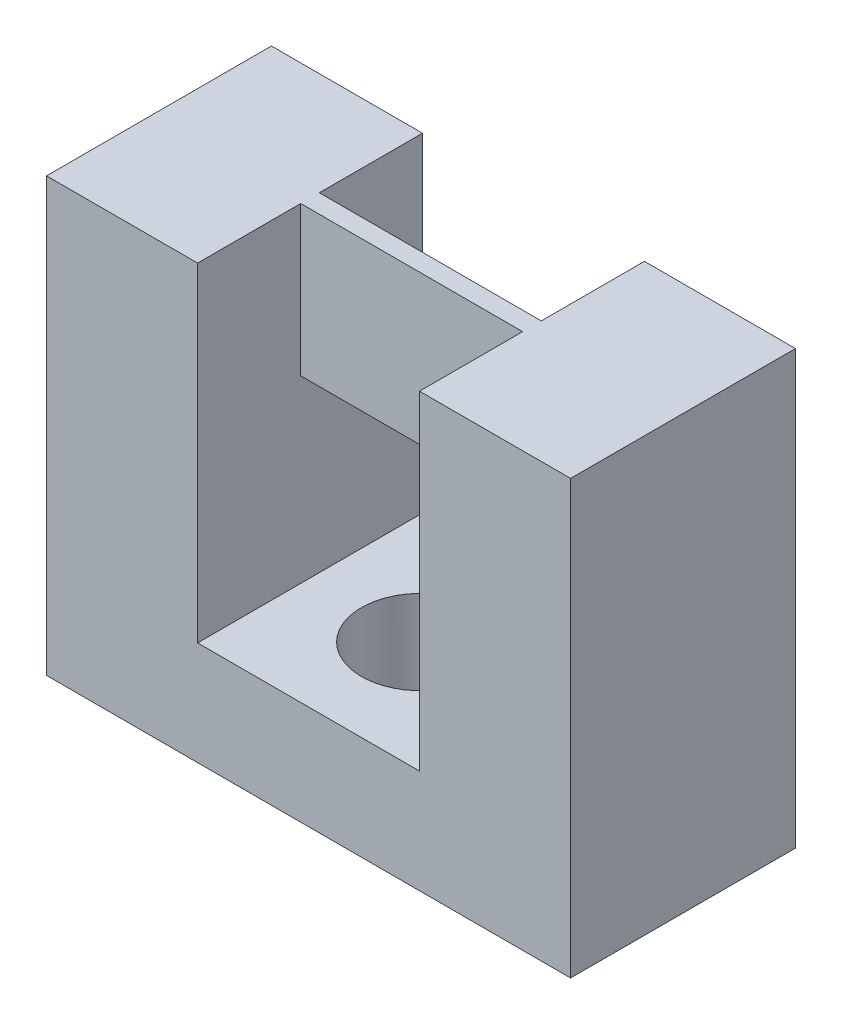
ISO-10303-21;
HEADER;
FILE_DESCRIPTION(('STEP AP214'),'2;1');
FILE_NAME('part.step','',(''),(''),'','','');
FILE_SCHEMA(('AUTOMOTIVE_DESIGN { 1 0 10303 214 1 1 1 1 }'));
ENDSEC;
DATA;
#1=APPLICATION_CONTEXT('core data for automotive mechanical design processes');
#2=APPLICATION_PROTOCOL_DEFINITION('international standard','automotive_design',2000,#1);
#3=PRODUCT_CONTEXT('',#1,'mechanical');
#4=PRODUCT('Part','Part','',(#3));
#5=PRODUCT_RELATED_PRODUCT_CATEGORY('part','',(#4));
#6=PRODUCT_DEFINITION_FORMATION('','',#4);
#7=PRODUCT_DEFINITION_CONTEXT('part definition',#1,'design');
#8=PRODUCT_DEFINITION('design','',#6,#7);
#9=PRODUCT_DEFINITION_SHAPE('','',#8);
#10=(LENGTH_UNIT() NAMED_UNIT(*) SI_UNIT(.MILLI.,.METRE.));
#11=(NAMED_UNIT(*) PLANE_ANGLE_UNIT() SI_UNIT($,.RADIAN.));
#12=(NAMED_UNIT(*) SI_UNIT($,.STERADIAN.) SOLID_ANGLE_UNIT());
#13=UNCERTAINTY_MEASURE_WITH_UNIT(LENGTH_MEASURE(1.E-05),#10,'distance_accuracy_value','');
#14=(GEOMETRIC_REPRESENTATION_CONTEXT(3) GLOBAL_UNCERTAINTY_ASSIGNED_CONTEXT((#13)) GLOBAL_UNIT_ASSIGNED_CONTEXT((#10,
#11,#12)) REPRESENTATION_CONTEXT('',''));
#15=CARTESIAN_POINT('',(0.,0.,0.));
#16=DIRECTION('',(0.,0.,1.));
#17=DIRECTION('',(1.,0.,0.));
#18=AXIS2_PLACEMENT_3D('',#15,#16,#17);
#19=CARTESIAN_POINT('',(2.975,5.8,0.));
#20=DIRECTION('',(1.,0.,0.));
#21=DIRECTION('',(0.,1.,0.));
#22=AXIS2_PLACEMENT_3D('',#19,#20,#21);
#23=PLANE('',#22);
#24=DIRECTION('',(0.,1.,0.));
#25=VECTOR('',#24,1.);
#26=CARTESIAN_POINT('',(2.975,5.8,3.265));
#27=LINE('',#26,#25);
#28=CARTESIAN_POINT('',(2.975,1.8,3.265));
#29=VERTEX_POINT('',#28);
#30=CARTESIAN_POINT('',(2.975,5.8,3.265));
#31=VERTEX_POINT('',#30);
#32=EDGE_CURVE('E143',#29,#31,#27,.T.);
#33=ORIENTED_EDGE('',*,*,#32,.F.);
#34=DIRECTION('',(0.,0.,1.));
#35=VECTOR('',#34,1.);
#36=CARTESIAN_POINT('',(2.975,1.8,0.));
#37=LINE('',#36,#35);
#38=CARTESIAN_POINT('',(2.975,1.8,2.765));
#39=VERTEX_POINT('',#38);
#40=EDGE_CURVE('E161',#39,#29,#37,.T.);
#41=ORIENTED_EDGE('',*,*,#40,.F.);
#42=DIRECTION('',(0.,-1.,0.));
#43=VECTOR('',#42,1.);
#44=CARTESIAN_POINT('',(2.975,5.8,2.765));
#45=LINE('',#44,#43);
#46=CARTESIAN_POINT('',(2.975,5.8,2.765));
#47=VERTEX_POINT('',#46);
#48=EDGE_CURVE('E159',#47,#39,#45,.T.);
#49=ORIENTED_EDGE('',*,*,#48,.F.);
#50=DIRECTION('',(0.,0.,1.));
#51=VECTOR('',#50,1.);
#52=CARTESIAN_POINT('',(2.975,5.8,0.));
#53=LINE('',#52,#51);
#54=CARTESIAN_POINT('',(2.975,5.8,0.));
#55=VERTEX_POINT('',#54);
#56=EDGE_CURVE('E180',#55,#47,#53,.T.);
#57=ORIENTED_EDGE('',*,*,#56,.F.);
#58=DIRECTION('',(0.,1.,0.));
#59=VECTOR('',#58,1.);
#60=CARTESIAN_POINT('',(2.975,5.8,0.));
#61=LINE('',#60,#59);
#62=CARTESIAN_POINT('',(2.975,-3.02,0.));
#63=VERTEX_POINT('',#62);
#64=EDGE_CURVE('E132',#63,#55,#61,.T.);
#65=ORIENTED_EDGE('',*,*,#64,.F.);
#66=DIRECTION('',(0.,0.,1.));
#67=VECTOR('',#66,1.);
#68=CARTESIAN_POINT('',(2.975,-3.02,0.));
#69=LINE('',#68,#67);
#70=CARTESIAN_POINT('',(2.975,-3.02,6.03));
#71=VERTEX_POINT('',#70);
#72=EDGE_CURVE('E184',#63,#71,#69,.T.);
#73=ORIENTED_EDGE('',*,*,#72,.T.);
#74=DIRECTION('',(0.,1.,0.));
#75=VECTOR('',#74,1.);
#76=CARTESIAN_POINT('',(2.975,5.8,6.03));
#77=LINE('',#76,#75);
#78=CARTESIAN_POINT('',(2.975,5.8,6.03));
#79=VERTEX_POINT('',#78);
#80=EDGE_CURVE('E169',#71,#79,#77,.T.);
#81=ORIENTED_EDGE('',*,*,#80,.T.);
#82=EDGE_CURVE('E183',#31,#79,#53,.T.);
#83=ORIENTED_EDGE('',*,*,#82,.F.);
#84=EDGE_LOOP('',(#33,#41,#49,#57,#65,#73,#81,#83));
#85=FACE_BOUND('',#84,.T.);
#86=ADVANCED_FACE('F36',(#85),#23,.F.);
#87=CARTESIAN_POINT('',(-2.975,-3.02,0.));
#88=DIRECTION('',(-1.,0.,0.));
#89=DIRECTION('',(0.,0.,1.));
#90=AXIS2_PLACEMENT_3D('',#87,#88,#89);
#91=PLANE('',#90);
#92=DIRECTION('',(0.,-1.,0.));
#93=VECTOR('',#92,1.);
#94=CARTESIAN_POINT('',(-2.975,5.8,3.265));
#95=LINE('',#94,#93);
#96=CARTESIAN_POINT('',(-2.975,5.8,3.265));
#97=VERTEX_POINT('',#96);
#98=CARTESIAN_POINT('',(-2.975,1.8,3.265));
#99=VERTEX_POINT('',#98);
#100=EDGE_CURVE('E135',#97,#99,#95,.T.);
#101=ORIENTED_EDGE('',*,*,#100,.F.);
#102=DIRECTION('',(0.,0.,1.));
#103=VECTOR('',#102,1.);
#104=CARTESIAN_POINT('',(-2.975,5.8,0.));
#105=LINE('',#104,#103);
#106=CARTESIAN_POINT('',(-2.975,5.8,6.03));
#107=VERTEX_POINT('',#106);
#108=EDGE_CURVE('E124',#97,#107,#105,.T.);
#109=ORIENTED_EDGE('',*,*,#108,.T.);
#110=DIRECTION('',(0.,-1.,0.));
#111=VECTOR('',#110,1.);
#112=CARTESIAN_POINT('',(-2.975,-3.02,6.03));
#113=LINE('',#112,#111);
#114=CARTESIAN_POINT('',(-2.975,-3.02,6.03));
#115=VERTEX_POINT('',#114);
#116=EDGE_CURVE('E164',#107,#115,#113,.T.);
#117=ORIENTED_EDGE('',*,*,#116,.T.);
#118=DIRECTION('',(0.,0.,1.));
#119=VECTOR('',#118,1.);
#120=CARTESIAN_POINT('',(-2.975,-3.02,0.));
#121=LINE('',#120,#119);
#122=CARTESIAN_POINT('',(-2.975,-3.02,0.));
#123=VERTEX_POINT('',#122);
#124=EDGE_CURVE('E186',#123,#115,#121,.T.);
#125=ORIENTED_EDGE('',*,*,#124,.F.);
#126=DIRECTION('',(0.,-1.,0.));
#127=VECTOR('',#126,1.);
#128=CARTESIAN_POINT('',(-2.975,-3.02,0.));
#129=LINE('',#128,#127);
#130=CARTESIAN_POINT('',(-2.975,5.8,0.));
#131=VERTEX_POINT('',#130);
#132=EDGE_CURVE('E165',#131,#123,#129,.T.);
#133=ORIENTED_EDGE('',*,*,#132,.F.);
#134=CARTESIAN_POINT('',(-2.975,5.8,2.765));
#135=VERTEX_POINT('',#134);
#136=EDGE_CURVE('E131',#131,#135,#105,.T.);
#137=ORIENTED_EDGE('',*,*,#136,.T.);
#138=DIRECTION('',(0.,1.,0.));
#139=VECTOR('',#138,1.);
#140=CARTESIAN_POINT('',(-2.975,5.8,2.765));
#141=LINE('',#140,#139);
#142=CARTESIAN_POINT('',(-2.975,1.8,2.765));
#143=VERTEX_POINT('',#142);
#144=EDGE_CURVE('E146',#143,#135,#141,.T.);
#145=ORIENTED_EDGE('',*,*,#144,.F.);
#146=DIRECTION('',(0.,0.,-1.));
#147=VECTOR('',#146,1.);
#148=CARTESIAN_POINT('',(-2.975,1.8,3.265));
#149=LINE('',#148,#147);
#150=EDGE_CURVE('E59',#99,#143,#149,.T.);
#151=ORIENTED_EDGE('',*,*,#150,.F.);
#152=EDGE_LOOP('',(#101,#109,#117,#125,#133,#137,#145,#151));
#153=FACE_BOUND('',#152,.T.);
#154=ADVANCED_FACE('F136',(#153),#91,.F.);
#155=CARTESIAN_POINT('',(7.025,-5.8,6.03));
#156=DIRECTION('',(-1.,0.,0.));
#157=DIRECTION('',(0.,0.,1.));
#158=AXIS2_PLACEMENT_3D('',#155,#156,#157);
#159=PLANE('',#158);
#160=DIRECTION('',(0.,1.,0.));
#161=VECTOR('',#160,1.);
#162=CARTESIAN_POINT('',(7.025,-5.8,0.));
#163=LINE('',#162,#161);
#164=CARTESIAN_POINT('',(7.025,-5.8,0.));
#165=VERTEX_POINT('',#164);
#166=CARTESIAN_POINT('',(7.025,5.8,0.));
#167=VERTEX_POINT('',#166);
#168=EDGE_CURVE('E182',#165,#167,#163,.T.);
#169=ORIENTED_EDGE('',*,*,#168,.T.);
#170=DIRECTION('',(0.,0.,-1.));
#171=VECTOR('',#170,1.);
#172=CARTESIAN_POINT('',(7.025,5.8,6.03));
#173=LINE('',#172,#171);
#174=CARTESIAN_POINT('',(7.025,5.8,6.03));
#175=VERTEX_POINT('',#174);
#176=EDGE_CURVE('E11',#175,#167,#173,.T.);
#177=ORIENTED_EDGE('',*,*,#176,.F.);
#178=DIRECTION('',(0.,1.,0.));
#179=VECTOR('',#178,1.);
#180=CARTESIAN_POINT('',(7.025,-5.8,6.03));
#181=LINE('',#180,#179);
#182=CARTESIAN_POINT('',(7.025,-5.8,6.03));
#183=VERTEX_POINT('',#182);
#184=EDGE_CURVE('E188',#183,#175,#181,.T.);
#185=ORIENTED_EDGE('',*,*,#184,.F.);
#186=DIRECTION('',(0.,0.,-1.));
#187=VECTOR('',#186,1.);
#188=CARTESIAN_POINT('',(7.025,-5.8,6.03));
#189=LINE('',#188,#187);
#190=EDGE_CURVE('E199',#183,#165,#189,.T.);
#191=ORIENTED_EDGE('',*,*,#190,.T.);
#192=EDGE_LOOP('',(#169,#177,#185,#191));
#193=FACE_BOUND('',#192,.T.);
#194=ADVANCED_FACE('F38',(#193),#159,.F.);
#195=CARTESIAN_POINT('',(-7.025,5.8,6.03));
#196=DIRECTION('',(0.,-1.,0.));
#197=DIRECTION('',(0.,0.,-1.));
#198=AXIS2_PLACEMENT_3D('',#195,#196,#197);
#199=PLANE('',#198);
#200=ORIENTED_EDGE('',*,*,#56,.T.);
#201=DIRECTION('',(-1.,0.,0.));
#202=VECTOR('',#201,1.);
#203=CARTESIAN_POINT('',(3.055,5.8,2.765));
#204=LINE('',#203,#202);
#205=EDGE_CURVE('E145',#47,#135,#204,.T.);
#206=ORIENTED_EDGE('',*,*,#205,.T.);
#207=ORIENTED_EDGE('',*,*,#136,.F.);
#208=DIRECTION('',(-1.,0.,0.));
#209=VECTOR('',#208,1.);
#210=CARTESIAN_POINT('',(-7.025,5.8,0.));
#211=LINE('',#210,#209);
#212=CARTESIAN_POINT('',(-7.025,5.8,0.));
#213=VERTEX_POINT('',#212);
#214=EDGE_CURVE('E202',#131,#213,#211,.T.);
#215=ORIENTED_EDGE('',*,*,#214,.T.);
#216=DIRECTION('',(0.,0.,-1.));
#217=VECTOR('',#216,1.);
#218=CARTESIAN_POINT('',(-7.025,5.8,6.03));
#219=LINE('',#218,#217);
#220=CARTESIAN_POINT('',(-7.025,5.8,6.03));
#221=VERTEX_POINT('',#220);
#222=EDGE_CURVE('E44',#221,#213,#219,.T.);
#223=ORIENTED_EDGE('',*,*,#222,.F.);
#224=DIRECTION('',(-1.,0.,0.));
#225=VECTOR('',#224,1.);
#226=CARTESIAN_POINT('',(-7.025,5.8,6.03));
#227=LINE('',#226,#225);
#228=EDGE_CURVE('E128',#107,#221,#227,.T.);
#229=ORIENTED_EDGE('',*,*,#228,.F.);
#230=ORIENTED_EDGE('',*,*,#108,.F.);
#231=DIRECTION('',(-1.,0.,0.));
#232=VECTOR('',#231,1.);
#233=CARTESIAN_POINT('',(3.055,5.8,3.265));
#234=LINE('',#233,#232);
#235=EDGE_CURVE('E51',#31,#97,#234,.T.);
#236=ORIENTED_EDGE('',*,*,#235,.F.);
#237=ORIENTED_EDGE('',*,*,#82,.T.);
#238=EDGE_CURVE('E192',#175,#79,#227,.T.);
#239=ORIENTED_EDGE('',*,*,#238,.F.);
#240=ORIENTED_EDGE('',*,*,#176,.T.);
#241=EDGE_CURVE('E203',#167,#55,#211,.T.);
#242=ORIENTED_EDGE('',*,*,#241,.T.);
#243=EDGE_LOOP('',(#200,#206,#207,#215,#223,#229,#230,#236,#237,#239,#240,#242));
#244=FACE_BOUND('',#243,.T.);
#245=ADVANCED_FACE('F126',(#244),#199,.F.);
#246=CARTESIAN_POINT('',(-7.025,-5.8,6.03));
#247=DIRECTION('',(1.,0.,0.));
#248=DIRECTION('',(0.,0.,-1.));
#249=AXIS2_PLACEMENT_3D('',#246,#247,#248);
#250=PLANE('',#249);
#251=DIRECTION('',(0.,-1.,0.));
#252=VECTOR('',#251,1.);
#253=CARTESIAN_POINT('',(-7.025,-5.8,0.));
#254=LINE('',#253,#252);
#255=CARTESIAN_POINT('',(-7.025,-5.8,0.));
#256=VERTEX_POINT('',#255);
#257=EDGE_CURVE('E206',#213,#256,#254,.T.);
#258=ORIENTED_EDGE('',*,*,#257,.T.);
#259=DIRECTION('',(0.,0.,-1.));
#260=VECTOR('',#259,1.);
#261=CARTESIAN_POINT('',(-7.025,-5.8,6.03));
#262=LINE('',#261,#260);
#263=CARTESIAN_POINT('',(-7.025,-5.8,6.03));
#264=VERTEX_POINT('',#263);
#265=EDGE_CURVE('E211',#264,#256,#262,.T.);
#266=ORIENTED_EDGE('',*,*,#265,.F.);
#267=DIRECTION('',(0.,-1.,0.));
#268=VECTOR('',#267,1.);
#269=CARTESIAN_POINT('',(-7.025,-5.8,6.03));
#270=LINE('',#269,#268);
#271=EDGE_CURVE('E195',#221,#264,#270,.T.);
#272=ORIENTED_EDGE('',*,*,#271,.F.);
#273=ORIENTED_EDGE('',*,*,#222,.T.);
#274=EDGE_LOOP('',(#258,#266,#272,#273));
#275=FACE_BOUND('',#274,.T.);
#276=ADVANCED_FACE('F217',(#275),#250,.F.);
#277=CARTESIAN_POINT('',(-7.025,-5.8,6.03));
#278=DIRECTION('',(0.,1.,0.));
#279=DIRECTION('',(0.,0.,1.));
#280=AXIS2_PLACEMENT_3D('',#277,#278,#279);
#281=PLANE('',#280);
#282=CARTESIAN_POINT('',(0.,-5.8,3.015));
#283=DIRECTION('',(0.,-1.,0.));
#284=DIRECTION('',(0.,0.,-1.));
#285=AXIS2_PLACEMENT_3D('',#282,#283,#284);
#286=CIRCLE('',#285,1.6);
#287=CARTESIAN_POINT('',(0.,-5.8,1.415));
#288=VERTEX_POINT('',#287);
#289=EDGE_CURVE('E359',#288,#288,#286,.T.);
#290=ORIENTED_EDGE('',*,*,#289,.F.);
#291=EDGE_LOOP('',(#290));
#292=FACE_BOUND('',#291,.T.);
#293=DIRECTION('',(1.,0.,0.));
#294=VECTOR('',#293,1.);
#295=CARTESIAN_POINT('',(-7.025,-5.8,0.));
#296=LINE('',#295,#294);
#297=EDGE_CURVE('E191',#256,#165,#296,.T.);
#298=ORIENTED_EDGE('',*,*,#297,.T.);
#299=ORIENTED_EDGE('',*,*,#190,.F.);
#300=DIRECTION('',(1.,0.,0.));
#301=VECTOR('',#300,1.);
#302=CARTESIAN_POINT('',(-7.025,-5.8,6.03));
#303=LINE('',#302,#301);
#304=EDGE_CURVE('E197',#264,#183,#303,.T.);
#305=ORIENTED_EDGE('',*,*,#304,.F.);
#306=ORIENTED_EDGE('',*,*,#265,.T.);
#307=EDGE_LOOP('',(#298,#299,#305,#306));
#308=FACE_BOUND('',#307,.T.);
#309=ADVANCED_FACE('F226',(#292,#308),#281,.F.);
#310=CARTESIAN_POINT('',(0.,0.,6.03));
#311=DIRECTION('',(0.,0.,-1.));
#312=DIRECTION('',(-1.,0.,0.));
#313=AXIS2_PLACEMENT_3D('',#310,#311,#312);
#314=PLANE('',#313);
#315=ORIENTED_EDGE('',*,*,#238,.T.);
#316=ORIENTED_EDGE('',*,*,#80,.F.);
#317=DIRECTION('',(1.,0.,0.));
#318=VECTOR('',#317,1.);
#319=CARTESIAN_POINT('',(2.975,-3.02,6.03));
#320=LINE('',#319,#318);
#321=EDGE_CURVE('E175',#115,#71,#320,.T.);
#322=ORIENTED_EDGE('',*,*,#321,.F.);
#323=ORIENTED_EDGE('',*,*,#116,.F.);
#324=ORIENTED_EDGE('',*,*,#228,.T.);
#325=ORIENTED_EDGE('',*,*,#271,.T.);
#326=ORIENTED_EDGE('',*,*,#304,.T.);
#327=ORIENTED_EDGE('',*,*,#184,.T.);
#328=EDGE_LOOP('',(#315,#316,#322,#323,#324,#325,#326,#327));
#329=FACE_BOUND('',#328,.T.);
#330=ADVANCED_FACE('F232',(#329),#314,.F.);
#331=CARTESIAN_POINT('',(0.,0.,0.));
#332=DIRECTION('',(0.,0.,-1.));
#333=DIRECTION('',(-1.,0.,0.));
#334=AXIS2_PLACEMENT_3D('',#331,#332,#333);
#335=PLANE('',#334);
#336=ORIENTED_EDGE('',*,*,#64,.T.);
#337=ORIENTED_EDGE('',*,*,#241,.F.);
#338=ORIENTED_EDGE('',*,*,#168,.F.);
#339=ORIENTED_EDGE('',*,*,#297,.F.);
#340=ORIENTED_EDGE('',*,*,#257,.F.);
#341=ORIENTED_EDGE('',*,*,#214,.F.);
#342=ORIENTED_EDGE('',*,*,#132,.T.);
#343=DIRECTION('',(1.,0.,0.));
#344=VECTOR('',#343,1.);
#345=CARTESIAN_POINT('',(2.975,-3.02,0.));
#346=LINE('',#345,#344);
#347=EDGE_CURVE('E168',#123,#63,#346,.T.);
#348=ORIENTED_EDGE('',*,*,#347,.T.);
#349=EDGE_LOOP('',(#336,#337,#338,#339,#340,#341,#342,#348));
#350=FACE_BOUND('',#349,.T.);
#351=ADVANCED_FACE('F222',(#350),#335,.T.);
#352=CARTESIAN_POINT('',(2.975,-3.02,0.));
#353=DIRECTION('',(0.,-1.,0.));
#354=DIRECTION('',(1.,0.,0.));
#355=AXIS2_PLACEMENT_3D('',#352,#353,#354);
#356=PLANE('',#355);
#357=CARTESIAN_POINT('',(0.,-3.02,3.015));
#358=DIRECTION('',(0.,-1.,0.));
#359=DIRECTION('',(1.,0.,0.));
#360=AXIS2_PLACEMENT_3D('',#357,#358,#359);
#361=CIRCLE('',#360,1.6);
#362=CARTESIAN_POINT('',(1.6,-3.02,3.015));
#363=VERTEX_POINT('',#362);
#364=EDGE_CURVE('E139',#363,#363,#361,.T.);
#365=ORIENTED_EDGE('',*,*,#364,.T.);
#366=EDGE_LOOP('',(#365));
#367=FACE_BOUND('',#366,.T.);
#368=ORIENTED_EDGE('',*,*,#321,.T.);
#369=ORIENTED_EDGE('',*,*,#72,.F.);
#370=ORIENTED_EDGE('',*,*,#347,.F.);
#371=ORIENTED_EDGE('',*,*,#124,.T.);
#372=EDGE_LOOP('',(#368,#369,#370,#371));
#373=FACE_BOUND('',#372,.T.);
#374=ADVANCED_FACE('F239',(#367,#373),#356,.F.);
#375=CARTESIAN_POINT('',(3.055,5.8,3.265));
#376=DIRECTION('',(0.,0.,-1.));
#377=DIRECTION('',(0.,1.,0.));
#378=AXIS2_PLACEMENT_3D('',#375,#376,#377);
#379=PLANE('',#378);
#380=DIRECTION('',(-1.,0.,0.));
#381=VECTOR('',#380,1.);
#382=CARTESIAN_POINT('',(3.055,1.8,3.265));
#383=LINE('',#382,#381);
#384=EDGE_CURVE('E157',#29,#99,#383,.T.);
#385=ORIENTED_EDGE('',*,*,#384,.F.);
#386=ORIENTED_EDGE('',*,*,#32,.T.);
#387=ORIENTED_EDGE('',*,*,#235,.T.);
#388=ORIENTED_EDGE('',*,*,#100,.T.);
#389=EDGE_LOOP('',(#385,#386,#387,#388));
#390=FACE_BOUND('',#389,.T.);
#391=ADVANCED_FACE('F141',(#390),#379,.F.);
#392=CARTESIAN_POINT('',(3.055,1.8,3.265));
#393=DIRECTION('',(0.,1.,0.));
#394=DIRECTION('',(0.,0.,1.));
#395=AXIS2_PLACEMENT_3D('',#392,#393,#394);
#396=PLANE('',#395);
#397=DIRECTION('',(-1.,0.,0.));
#398=VECTOR('',#397,1.);
#399=CARTESIAN_POINT('',(3.055,1.8,2.765));
#400=LINE('',#399,#398);
#401=EDGE_CURVE('E149',#39,#143,#400,.T.);
#402=ORIENTED_EDGE('',*,*,#401,.F.);
#403=ORIENTED_EDGE('',*,*,#40,.T.);
#404=ORIENTED_EDGE('',*,*,#384,.T.);
#405=ORIENTED_EDGE('',*,*,#150,.T.);
#406=EDGE_LOOP('',(#402,#403,#404,#405));
#407=FACE_BOUND('',#406,.T.);
#408=ADVANCED_FACE('F245',(#407),#396,.F.);
#409=CARTESIAN_POINT('',(3.055,5.8,2.765));
#410=DIRECTION('',(0.,0.,1.));
#411=DIRECTION('',(1.,0.,0.));
#412=AXIS2_PLACEMENT_3D('',#409,#410,#411);
#413=PLANE('',#412);
#414=ORIENTED_EDGE('',*,*,#205,.F.);
#415=ORIENTED_EDGE('',*,*,#48,.T.);
#416=ORIENTED_EDGE('',*,*,#401,.T.);
#417=ORIENTED_EDGE('',*,*,#144,.T.);
#418=EDGE_LOOP('',(#414,#415,#416,#417));
#419=FACE_BOUND('',#418,.T.);
#420=ADVANCED_FACE('F247',(#419),#413,.F.);
#421=CARTESIAN_POINT('',(0.,-5.8,3.015));
#422=DIRECTION('',(0.,-1.,0.));
#423=DIRECTION('',(0.,0.,-1.));
#424=AXIS2_PLACEMENT_3D('',#421,#422,#423);
#425=CYLINDRICAL_SURFACE('',#424,1.6);
#426=ORIENTED_EDGE('',*,*,#364,.F.);
#427=EDGE_LOOP('',(#426));
#428=FACE_BOUND('',#427,.T.);
#429=ORIENTED_EDGE('',*,*,#289,.T.);
#430=EDGE_LOOP('',(#429));
#431=FACE_BOUND('',#430,.T.);
#432=ADVANCED_FACE('F249',(#428,#431),#425,.F.);
#433=CLOSED_SHELL('',(#86,#154,#194,#245,#276,#309,#330,#351,#374,#391,#408,#420,#432));
#434=MANIFOLD_SOLID_BREP('B2',#433);
#435=ADVANCED_BREP_SHAPE_REPRESENTATION('',(#18,#434),#14);
#436=SHAPE_DEFINITION_REPRESENTATION(#9,#435);
ENDSEC;
END-ISO-10303-21;
